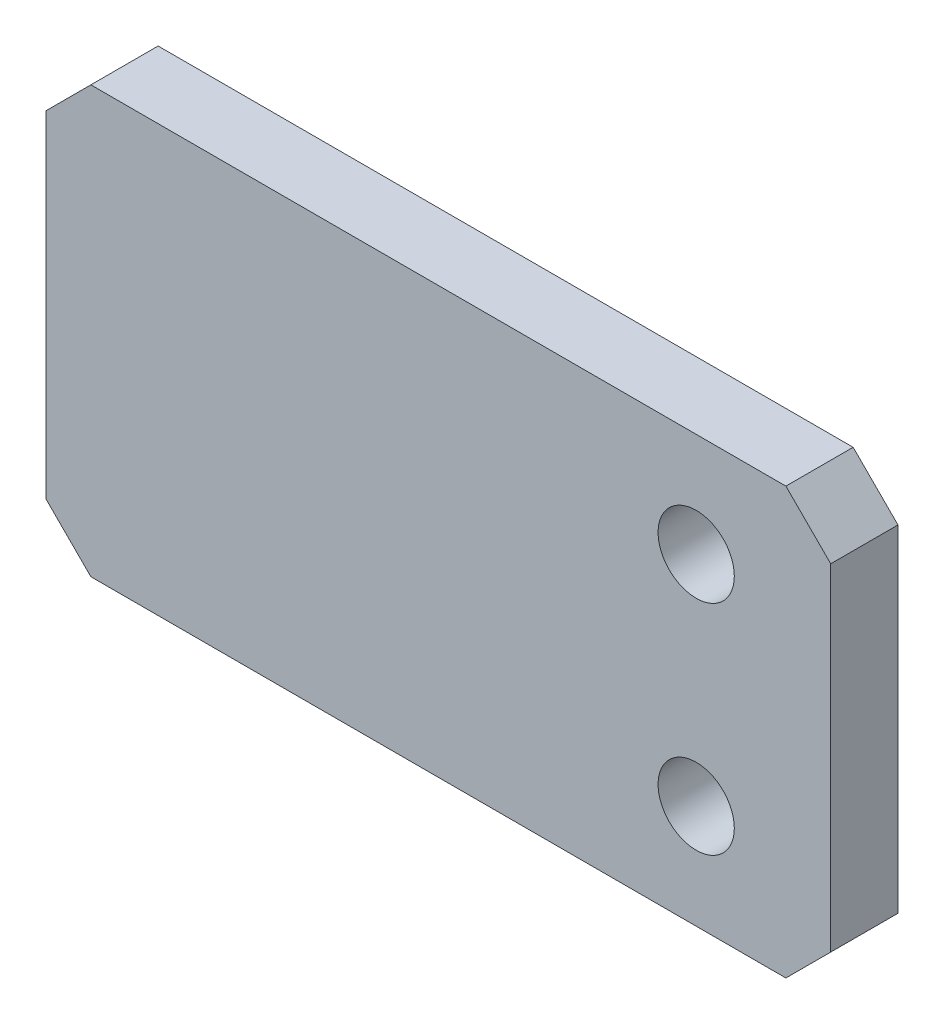
ISO-10303-21;
HEADER;
FILE_DESCRIPTION(('STEP AP214'),'2;1');
FILE_NAME('part.step','',(''),(''),'','','');
FILE_SCHEMA(('AUTOMOTIVE_DESIGN { 1 0 10303 214 1 1 1 1 }'));
ENDSEC;
DATA;
#1=APPLICATION_CONTEXT('core data for automotive mechanical design processes');
#2=APPLICATION_PROTOCOL_DEFINITION('international standard','automotive_design',2000,#1);
#3=PRODUCT_CONTEXT('',#1,'mechanical');
#4=PRODUCT('Part','Part','',(#3));
#5=PRODUCT_RELATED_PRODUCT_CATEGORY('part','',(#4));
#6=PRODUCT_DEFINITION_FORMATION('','',#4);
#7=PRODUCT_DEFINITION_CONTEXT('part definition',#1,'design');
#8=PRODUCT_DEFINITION('design','',#6,#7);
#9=PRODUCT_DEFINITION_SHAPE('','',#8);
#10=(LENGTH_UNIT() NAMED_UNIT(*) SI_UNIT(.MILLI.,.METRE.));
#11=(NAMED_UNIT(*) PLANE_ANGLE_UNIT() SI_UNIT($,.RADIAN.));
#12=(NAMED_UNIT(*) SI_UNIT($,.STERADIAN.) SOLID_ANGLE_UNIT());
#13=UNCERTAINTY_MEASURE_WITH_UNIT(LENGTH_MEASURE(1.E-05),#10,'distance_accuracy_value','');
#14=(GEOMETRIC_REPRESENTATION_CONTEXT(3) GLOBAL_UNCERTAINTY_ASSIGNED_CONTEXT((#13)) GLOBAL_UNIT_ASSIGNED_CONTEXT((#10,
#11,#12)) REPRESENTATION_CONTEXT('',''));
#15=CARTESIAN_POINT('',(0.,0.,0.));
#16=DIRECTION('',(0.,0.,1.));
#17=DIRECTION('',(1.,0.,0.));
#18=AXIS2_PLACEMENT_3D('',#15,#16,#17);
#19=CARTESIAN_POINT('',(17.5,-9.5,3.));
#20=DIRECTION('',(-1.,0.,0.));
#21=DIRECTION('',(0.,0.,1.));
#22=AXIS2_PLACEMENT_3D('',#19,#20,#21);
#23=PLANE('',#22);
#24=DIRECTION('',(0.,1.,0.));
#25=VECTOR('',#24,1.);
#26=CARTESIAN_POINT('',(17.5,-9.5,3.));
#27=LINE('',#26,#25);
#28=CARTESIAN_POINT('',(17.5,-7.5,3.));
#29=VERTEX_POINT('',#28);
#30=CARTESIAN_POINT('',(17.5,7.49999999999999,3.));
#31=VERTEX_POINT('',#30);
#32=EDGE_CURVE('E125',#29,#31,#27,.T.);
#33=ORIENTED_EDGE('',*,*,#32,.F.);
#34=DIRECTION('',(0.,0.,-1.));
#35=VECTOR('',#34,1.);
#36=CARTESIAN_POINT('',(17.5,-7.5,3.));
#37=LINE('',#36,#35);
#38=CARTESIAN_POINT('',(17.5,-7.5,0.));
#39=VERTEX_POINT('',#38);
#40=EDGE_CURVE('E151',#29,#39,#37,.T.);
#41=ORIENTED_EDGE('',*,*,#40,.T.);
#42=DIRECTION('',(0.,1.,0.));
#43=VECTOR('',#42,1.);
#44=CARTESIAN_POINT('',(17.5,-9.5,0.));
#45=LINE('',#44,#43);
#46=CARTESIAN_POINT('',(17.5,7.49999999999999,0.));
#47=VERTEX_POINT('',#46);
#48=EDGE_CURVE('E157',#39,#47,#45,.T.);
#49=ORIENTED_EDGE('',*,*,#48,.T.);
#50=DIRECTION('',(0.,0.,1.));
#51=VECTOR('',#50,1.);
#52=CARTESIAN_POINT('',(17.5,7.49999999999999,3.));
#53=LINE('',#52,#51);
#54=EDGE_CURVE('E149',#47,#31,#53,.T.);
#55=ORIENTED_EDGE('',*,*,#54,.T.);
#56=EDGE_LOOP('',(#33,#41,#49,#55));
#57=FACE_BOUND('',#56,.T.);
#58=ADVANCED_FACE('F33',(#57),#23,.F.);
#59=CARTESIAN_POINT('',(-17.5,9.5,3.));
#60=DIRECTION('',(0.,-1.,0.));
#61=DIRECTION('',(0.,0.,-1.));
#62=AXIS2_PLACEMENT_3D('',#59,#60,#61);
#63=PLANE('',#62);
#64=DIRECTION('',(-1.,0.,0.));
#65=VECTOR('',#64,1.);
#66=CARTESIAN_POINT('',(-17.5,9.5,3.));
#67=LINE('',#66,#65);
#68=CARTESIAN_POINT('',(15.5,9.5,3.));
#69=VERTEX_POINT('',#68);
#70=CARTESIAN_POINT('',(-15.5,9.5,3.));
#71=VERTEX_POINT('',#70);
#72=EDGE_CURVE('E128',#69,#71,#67,.T.);
#73=ORIENTED_EDGE('',*,*,#72,.F.);
#74=DIRECTION('',(0.,0.,-1.));
#75=VECTOR('',#74,1.);
#76=CARTESIAN_POINT('',(15.5,9.5,3.));
#77=LINE('',#76,#75);
#78=CARTESIAN_POINT('',(15.5,9.5,0.));
#79=VERTEX_POINT('',#78);
#80=EDGE_CURVE('E11',#69,#79,#77,.T.);
#81=ORIENTED_EDGE('',*,*,#80,.T.);
#82=DIRECTION('',(-1.,0.,0.));
#83=VECTOR('',#82,1.);
#84=CARTESIAN_POINT('',(-17.5,9.5,0.));
#85=LINE('',#84,#83);
#86=CARTESIAN_POINT('',(-15.5,9.5,0.));
#87=VERTEX_POINT('',#86);
#88=EDGE_CURVE('E130',#79,#87,#85,.T.);
#89=ORIENTED_EDGE('',*,*,#88,.T.);
#90=DIRECTION('',(0.,0.,1.));
#91=VECTOR('',#90,1.);
#92=CARTESIAN_POINT('',(-15.5,9.5,3.));
#93=LINE('',#92,#91);
#94=EDGE_CURVE('E41',#87,#71,#93,.T.);
#95=ORIENTED_EDGE('',*,*,#94,.T.);
#96=EDGE_LOOP('',(#73,#81,#89,#95));
#97=FACE_BOUND('',#96,.T.);
#98=ADVANCED_FACE('F196',(#97),#63,.F.);
#99=CARTESIAN_POINT('',(-17.5,-9.5,3.));
#100=DIRECTION('',(1.,0.,0.));
#101=DIRECTION('',(0.,0.,-1.));
#102=AXIS2_PLACEMENT_3D('',#99,#100,#101);
#103=PLANE('',#102);
#104=DIRECTION('',(0.,-1.,0.));
#105=VECTOR('',#104,1.);
#106=CARTESIAN_POINT('',(-17.5,-9.5,0.));
#107=LINE('',#106,#105);
#108=CARTESIAN_POINT('',(-17.5,7.49999999999999,0.));
#109=VERTEX_POINT('',#108);
#110=CARTESIAN_POINT('',(-17.5,-7.49999999999999,0.));
#111=VERTEX_POINT('',#110);
#112=EDGE_CURVE('E126',#109,#111,#107,.T.);
#113=ORIENTED_EDGE('',*,*,#112,.T.);
#114=DIRECTION('',(0.,0.,1.));
#115=VECTOR('',#114,1.);
#116=CARTESIAN_POINT('',(-17.5,-7.49999999999999,3.));
#117=LINE('',#116,#115);
#118=CARTESIAN_POINT('',(-17.5,-7.49999999999999,3.));
#119=VERTEX_POINT('',#118);
#120=EDGE_CURVE('E104',#111,#119,#117,.T.);
#121=ORIENTED_EDGE('',*,*,#120,.T.);
#122=DIRECTION('',(0.,-1.,0.));
#123=VECTOR('',#122,1.);
#124=CARTESIAN_POINT('',(-17.5,-9.5,3.));
#125=LINE('',#124,#123);
#126=CARTESIAN_POINT('',(-17.5,7.5,3.));
#127=VERTEX_POINT('',#126);
#128=EDGE_CURVE('E169',#127,#119,#125,.T.);
#129=ORIENTED_EDGE('',*,*,#128,.F.);
#130=DIRECTION('',(0.,0.,-1.));
#131=VECTOR('',#130,1.);
#132=CARTESIAN_POINT('',(-17.5,7.5,3.));
#133=LINE('',#132,#131);
#134=EDGE_CURVE('E109',#127,#109,#133,.T.);
#135=ORIENTED_EDGE('',*,*,#134,.T.);
#136=EDGE_LOOP('',(#113,#121,#129,#135));
#137=FACE_BOUND('',#136,.T.);
#138=ADVANCED_FACE('F194',(#137),#103,.F.);
#139=CARTESIAN_POINT('',(-17.5,-9.5,3.));
#140=DIRECTION('',(0.,1.,0.));
#141=DIRECTION('',(0.,0.,1.));
#142=AXIS2_PLACEMENT_3D('',#139,#140,#141);
#143=PLANE('',#142);
#144=DIRECTION('',(1.,0.,0.));
#145=VECTOR('',#144,1.);
#146=CARTESIAN_POINT('',(-17.5,-9.5,3.));
#147=LINE('',#146,#145);
#148=CARTESIAN_POINT('',(-15.5,-9.5,3.));
#149=VERTEX_POINT('',#148);
#150=CARTESIAN_POINT('',(15.5,-9.5,3.));
#151=VERTEX_POINT('',#150);
#152=EDGE_CURVE('E119',#149,#151,#147,.T.);
#153=ORIENTED_EDGE('',*,*,#152,.F.);
#154=DIRECTION('',(0.,0.,-1.));
#155=VECTOR('',#154,1.);
#156=CARTESIAN_POINT('',(-15.5,-9.5,3.));
#157=LINE('',#156,#155);
#158=CARTESIAN_POINT('',(-15.5,-9.5,0.));
#159=VERTEX_POINT('',#158);
#160=EDGE_CURVE('E103',#149,#159,#157,.T.);
#161=ORIENTED_EDGE('',*,*,#160,.T.);
#162=DIRECTION('',(1.,0.,0.));
#163=VECTOR('',#162,1.);
#164=CARTESIAN_POINT('',(-17.5,-9.5,0.));
#165=LINE('',#164,#163);
#166=CARTESIAN_POINT('',(15.5,-9.5,0.));
#167=VERTEX_POINT('',#166);
#168=EDGE_CURVE('E116',#159,#167,#165,.T.);
#169=ORIENTED_EDGE('',*,*,#168,.T.);
#170=DIRECTION('',(0.,0.,1.));
#171=VECTOR('',#170,1.);
#172=CARTESIAN_POINT('',(15.5,-9.5,3.));
#173=LINE('',#172,#171);
#174=EDGE_CURVE('E121',#167,#151,#173,.T.);
#175=ORIENTED_EDGE('',*,*,#174,.T.);
#176=EDGE_LOOP('',(#153,#161,#169,#175));
#177=FACE_BOUND('',#176,.T.);
#178=ADVANCED_FACE('F115',(#177),#143,.F.);
#179=CARTESIAN_POINT('',(0.,0.,3.));
#180=DIRECTION('',(0.,0.,-1.));
#181=DIRECTION('',(-1.,0.,0.));
#182=AXIS2_PLACEMENT_3D('',#179,#180,#181);
#183=PLANE('',#182);
#184=CARTESIAN_POINT('',(11.5,4.86631167877505,3.));
#185=DIRECTION('',(0.,0.,1.));
#186=DIRECTION('',(1.,0.,0.));
#187=AXIS2_PLACEMENT_3D('',#184,#185,#186);
#188=CIRCLE('',#187,1.69999999999999);
#189=CARTESIAN_POINT('',(13.2,4.86631167877505,3.));
#190=VERTEX_POINT('',#189);
#191=EDGE_CURVE('E178',#190,#190,#188,.T.);
#192=ORIENTED_EDGE('',*,*,#191,.F.);
#193=EDGE_LOOP('',(#192));
#194=FACE_BOUND('',#193,.T.);
#195=CARTESIAN_POINT('',(11.5,-4.86631167877506,3.));
#196=DIRECTION('',(0.,0.,1.));
#197=DIRECTION('',(1.,0.,0.));
#198=AXIS2_PLACEMENT_3D('',#195,#196,#197);
#199=CIRCLE('',#198,1.69999999999999);
#200=CARTESIAN_POINT('',(13.2,-4.86631167877506,3.));
#201=VERTEX_POINT('',#200);
#202=EDGE_CURVE('E165',#201,#201,#199,.T.);
#203=ORIENTED_EDGE('',*,*,#202,.F.);
#204=EDGE_LOOP('',(#203));
#205=FACE_BOUND('',#204,.T.);
#206=ORIENTED_EDGE('',*,*,#128,.T.);
#207=DIRECTION('',(-0.707106781186546,0.707106781186549,0.));
#208=VECTOR('',#207,1.);
#209=CARTESIAN_POINT('',(-15.5,-9.5,3.));
#210=LINE('',#209,#208);
#211=EDGE_CURVE('E147',#119,#149,#210,.F.);
#212=ORIENTED_EDGE('',*,*,#211,.T.);
#213=ORIENTED_EDGE('',*,*,#152,.T.);
#214=DIRECTION('',(-0.707106781186549,-0.707106781186546,0.));
#215=VECTOR('',#214,1.);
#216=CARTESIAN_POINT('',(17.5,-7.5,3.));
#217=LINE('',#216,#215);
#218=EDGE_CURVE('E145',#151,#29,#217,.F.);
#219=ORIENTED_EDGE('',*,*,#218,.T.);
#220=ORIENTED_EDGE('',*,*,#32,.T.);
#221=DIRECTION('',(0.707106781186546,-0.707106781186549,0.));
#222=VECTOR('',#221,1.);
#223=CARTESIAN_POINT('',(15.5,9.5,3.));
#224=LINE('',#223,#222);
#225=EDGE_CURVE('E54',#31,#69,#224,.F.);
#226=ORIENTED_EDGE('',*,*,#225,.T.);
#227=ORIENTED_EDGE('',*,*,#72,.T.);
#228=DIRECTION('',(0.707106781186549,0.707106781186546,0.));
#229=VECTOR('',#228,1.);
#230=CARTESIAN_POINT('',(-17.5,7.5,3.));
#231=LINE('',#230,#229);
#232=EDGE_CURVE('E142',#71,#127,#231,.F.);
#233=ORIENTED_EDGE('',*,*,#232,.T.);
#234=EDGE_LOOP('',(#206,#212,#213,#219,#220,#226,#227,#233));
#235=FACE_BOUND('',#234,.T.);
#236=ADVANCED_FACE('F185',(#194,#205,#235),#183,.F.);
#237=CARTESIAN_POINT('',(0.,0.,0.));
#238=DIRECTION('',(0.,0.,-1.));
#239=DIRECTION('',(-1.,0.,0.));
#240=AXIS2_PLACEMENT_3D('',#237,#238,#239);
#241=PLANE('',#240);
#242=CARTESIAN_POINT('',(11.5,4.86631167877505,0.));
#243=DIRECTION('',(0.,0.,-1.));
#244=DIRECTION('',(-1.,0.,0.));
#245=AXIS2_PLACEMENT_3D('',#242,#243,#244);
#246=CIRCLE('',#245,1.69999999999999);
#247=CARTESIAN_POINT('',(9.80000000000001,4.86631167877505,0.));
#248=VERTEX_POINT('',#247);
#249=EDGE_CURVE('E175',#248,#248,#246,.T.);
#250=ORIENTED_EDGE('',*,*,#249,.F.);
#251=EDGE_LOOP('',(#250));
#252=FACE_BOUND('',#251,.T.);
#253=CARTESIAN_POINT('',(11.5,-4.86631167877506,0.));
#254=DIRECTION('',(0.,0.,-1.));
#255=DIRECTION('',(-1.,0.,0.));
#256=AXIS2_PLACEMENT_3D('',#253,#254,#255);
#257=CIRCLE('',#256,1.69999999999999);
#258=CARTESIAN_POINT('',(9.80000000000001,-4.86631167877506,0.));
#259=VERTEX_POINT('',#258);
#260=EDGE_CURVE('E162',#259,#259,#257,.T.);
#261=ORIENTED_EDGE('',*,*,#260,.F.);
#262=EDGE_LOOP('',(#261));
#263=FACE_BOUND('',#262,.T.);
#264=ORIENTED_EDGE('',*,*,#168,.F.);
#265=DIRECTION('',(0.707106781186546,-0.707106781186549,0.));
#266=VECTOR('',#265,1.);
#267=CARTESIAN_POINT('',(-12.5,-12.5,0.));
#268=LINE('',#267,#266);
#269=EDGE_CURVE('E99',#159,#111,#268,.F.);
#270=ORIENTED_EDGE('',*,*,#269,.T.);
#271=ORIENTED_EDGE('',*,*,#112,.F.);
#272=DIRECTION('',(-0.707106781186549,-0.707106781186546,0.));
#273=VECTOR('',#272,1.);
#274=CARTESIAN_POINT('',(-12.5,12.5,0.));
#275=LINE('',#274,#273);
#276=EDGE_CURVE('E120',#109,#87,#275,.F.);
#277=ORIENTED_EDGE('',*,*,#276,.T.);
#278=ORIENTED_EDGE('',*,*,#88,.F.);
#279=DIRECTION('',(-0.707106781186546,0.707106781186549,0.));
#280=VECTOR('',#279,1.);
#281=CARTESIAN_POINT('',(12.5,12.5,0.));
#282=LINE('',#281,#280);
#283=EDGE_CURVE('E136',#79,#47,#282,.F.);
#284=ORIENTED_EDGE('',*,*,#283,.T.);
#285=ORIENTED_EDGE('',*,*,#48,.F.);
#286=DIRECTION('',(0.707106781186549,0.707106781186546,0.));
#287=VECTOR('',#286,1.);
#288=CARTESIAN_POINT('',(12.5,-12.5,0.));
#289=LINE('',#288,#287);
#290=EDGE_CURVE('E110',#39,#167,#289,.F.);
#291=ORIENTED_EDGE('',*,*,#290,.T.);
#292=EDGE_LOOP('',(#264,#270,#271,#277,#278,#284,#285,#291));
#293=FACE_BOUND('',#292,.T.);
#294=ADVANCED_FACE('F123',(#252,#263,#293),#241,.T.);
#295=CARTESIAN_POINT('',(-15.5,-9.5,3.));
#296=DIRECTION('',(0.707106781186549,0.707106781186546,0.));
#297=DIRECTION('',(0.,0.,-1.));
#298=AXIS2_PLACEMENT_3D('',#295,#296,#297);
#299=PLANE('',#298);
#300=ORIENTED_EDGE('',*,*,#211,.F.);
#301=ORIENTED_EDGE('',*,*,#120,.F.);
#302=ORIENTED_EDGE('',*,*,#269,.F.);
#303=ORIENTED_EDGE('',*,*,#160,.F.);
#304=EDGE_LOOP('',(#300,#301,#302,#303));
#305=FACE_BOUND('',#304,.T.);
#306=ADVANCED_FACE('F102',(#305),#299,.F.);
#307=CARTESIAN_POINT('',(17.5,-7.5,3.));
#308=DIRECTION('',(-0.707106781186546,0.707106781186549,0.));
#309=DIRECTION('',(0.,0.,-1.));
#310=AXIS2_PLACEMENT_3D('',#307,#308,#309);
#311=PLANE('',#310);
#312=ORIENTED_EDGE('',*,*,#218,.F.);
#313=ORIENTED_EDGE('',*,*,#174,.F.);
#314=ORIENTED_EDGE('',*,*,#290,.F.);
#315=ORIENTED_EDGE('',*,*,#40,.F.);
#316=EDGE_LOOP('',(#312,#313,#314,#315));
#317=FACE_BOUND('',#316,.T.);
#318=ADVANCED_FACE('F200',(#317),#311,.F.);
#319=CARTESIAN_POINT('',(15.5,9.5,3.));
#320=DIRECTION('',(-0.707106781186549,-0.707106781186546,0.));
#321=DIRECTION('',(0.,0.,-1.));
#322=AXIS2_PLACEMENT_3D('',#319,#320,#321);
#323=PLANE('',#322);
#324=ORIENTED_EDGE('',*,*,#225,.F.);
#325=ORIENTED_EDGE('',*,*,#54,.F.);
#326=ORIENTED_EDGE('',*,*,#283,.F.);
#327=ORIENTED_EDGE('',*,*,#80,.F.);
#328=EDGE_LOOP('',(#324,#325,#326,#327));
#329=FACE_BOUND('',#328,.T.);
#330=ADVANCED_FACE('F199',(#329),#323,.F.);
#331=CARTESIAN_POINT('',(-17.5,7.5,3.));
#332=DIRECTION('',(0.707106781186546,-0.707106781186549,0.));
#333=DIRECTION('',(0.,0.,-1.));
#334=AXIS2_PLACEMENT_3D('',#331,#332,#333);
#335=PLANE('',#334);
#336=ORIENTED_EDGE('',*,*,#232,.F.);
#337=ORIENTED_EDGE('',*,*,#94,.F.);
#338=ORIENTED_EDGE('',*,*,#276,.F.);
#339=ORIENTED_EDGE('',*,*,#134,.F.);
#340=EDGE_LOOP('',(#336,#337,#338,#339));
#341=FACE_BOUND('',#340,.T.);
#342=ADVANCED_FACE('F35',(#341),#335,.F.);
#343=CARTESIAN_POINT('',(11.5,-4.86631167877506,3.));
#344=DIRECTION('',(0.,0.,1.));
#345=DIRECTION('',(1.,0.,0.));
#346=AXIS2_PLACEMENT_3D('',#343,#344,#345);
#347=CYLINDRICAL_SURFACE('',#346,1.69999999999999);
#348=ORIENTED_EDGE('',*,*,#202,.T.);
#349=EDGE_LOOP('',(#348));
#350=FACE_BOUND('',#349,.T.);
#351=ORIENTED_EDGE('',*,*,#260,.T.);
#352=EDGE_LOOP('',(#351));
#353=FACE_BOUND('',#352,.T.);
#354=ADVANCED_FACE('F222',(#350,#353),#347,.F.);
#355=CARTESIAN_POINT('',(11.5,4.86631167877505,3.));
#356=DIRECTION('',(0.,0.,1.));
#357=DIRECTION('',(1.,0.,0.));
#358=AXIS2_PLACEMENT_3D('',#355,#356,#357);
#359=CYLINDRICAL_SURFACE('',#358,1.69999999999999);
#360=ORIENTED_EDGE('',*,*,#191,.T.);
#361=EDGE_LOOP('',(#360));
#362=FACE_BOUND('',#361,.T.);
#363=ORIENTED_EDGE('',*,*,#249,.T.);
#364=EDGE_LOOP('',(#363));
#365=FACE_BOUND('',#364,.T.);
#366=ADVANCED_FACE('F182',(#362,#365),#359,.F.);
#367=CLOSED_SHELL('',(#58,#98,#138,#178,#236,#294,#306,#318,#330,#342,#354,#366));
#368=MANIFOLD_SOLID_BREP('B2',#367);
#369=ADVANCED_BREP_SHAPE_REPRESENTATION('',(#18,#368),#14);
#370=SHAPE_DEFINITION_REPRESENTATION(#9,#369);
ENDSEC;
END-ISO-10303-21;
